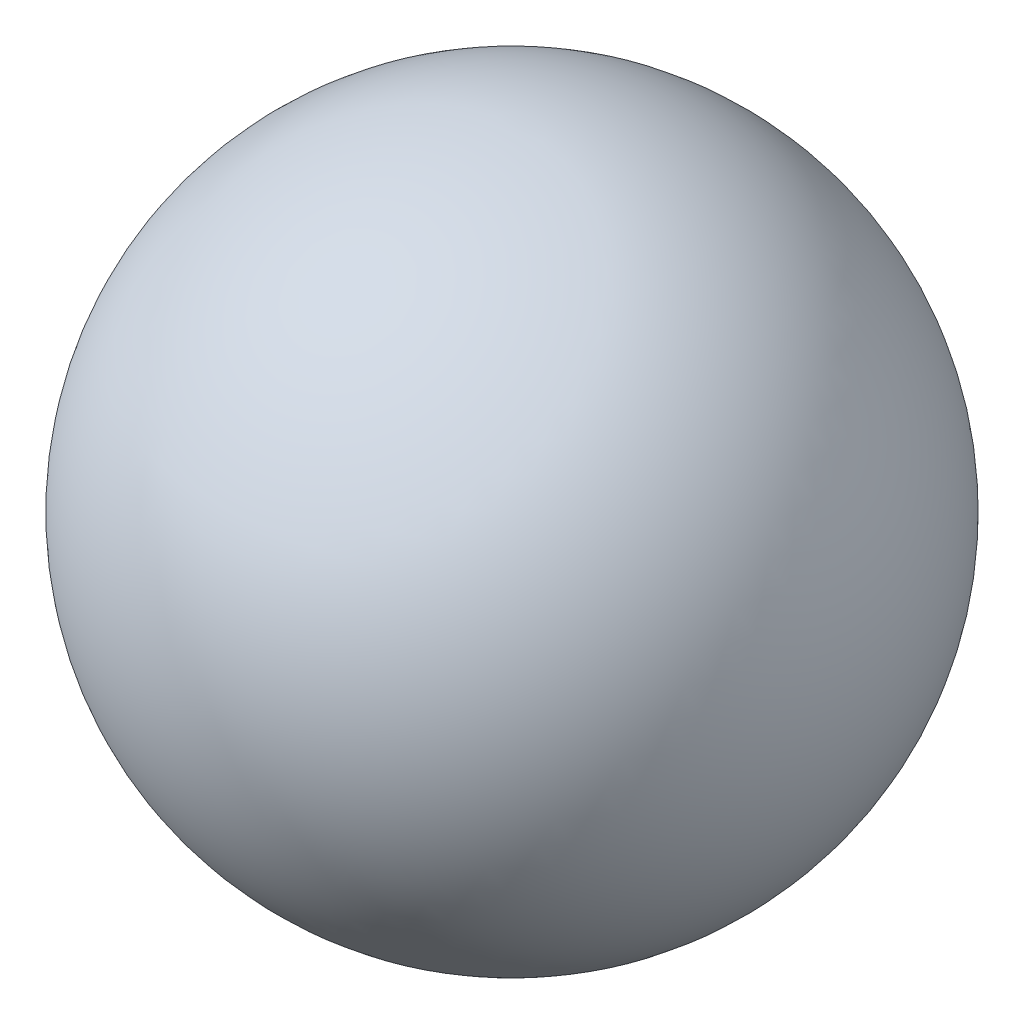
ISO-10303-21;
HEADER;
FILE_DESCRIPTION(('STEP AP214'),'2;1');
FILE_NAME('part.step','',(''),(''),'','','');
FILE_SCHEMA(('AUTOMOTIVE_DESIGN { 1 0 10303 214 1 1 1 1 }'));
ENDSEC;
DATA;
#1=APPLICATION_CONTEXT('core data for automotive mechanical design processes');
#2=APPLICATION_PROTOCOL_DEFINITION('international standard','automotive_design',2000,#1);
#3=PRODUCT_CONTEXT('',#1,'mechanical');
#4=PRODUCT('Part','Part','',(#3));
#5=PRODUCT_RELATED_PRODUCT_CATEGORY('part','',(#4));
#6=PRODUCT_DEFINITION_FORMATION('','',#4);
#7=PRODUCT_DEFINITION_CONTEXT('part definition',#1,'design');
#8=PRODUCT_DEFINITION('design','',#6,#7);
#9=PRODUCT_DEFINITION_SHAPE('','',#8);
#10=(LENGTH_UNIT() NAMED_UNIT(*) SI_UNIT(.MILLI.,.METRE.));
#11=(NAMED_UNIT(*) PLANE_ANGLE_UNIT() SI_UNIT($,.RADIAN.));
#12=(NAMED_UNIT(*) SI_UNIT($,.STERADIAN.) SOLID_ANGLE_UNIT());
#13=UNCERTAINTY_MEASURE_WITH_UNIT(LENGTH_MEASURE(1.E-05),#10,'distance_accuracy_value','');
#14=(GEOMETRIC_REPRESENTATION_CONTEXT(3) GLOBAL_UNCERTAINTY_ASSIGNED_CONTEXT((#13)) GLOBAL_UNIT_ASSIGNED_CONTEXT((#10,
#11,#12)) REPRESENTATION_CONTEXT('',''));
#15=CARTESIAN_POINT('',(0.,0.,0.));
#16=DIRECTION('',(0.,0.,1.));
#17=DIRECTION('',(1.,0.,0.));
#18=AXIS2_PLACEMENT_3D('',#15,#16,#17);
#19=CARTESIAN_POINT('',(0.,0.,0.));
#20=DIRECTION('',(0.,-1.,0.));
#21=DIRECTION('',(-1.,0.,0.));
#22=AXIS2_PLACEMENT_3D('',#19,#20,#21);
#23=SPHERICAL_SURFACE('',#22,9.525);
#24=CARTESIAN_POINT('',(0.,-9.525,0.));
#25=VERTEX_POINT('',#24);
#26=VERTEX_LOOP('',#25);
#27=FACE_BOUND('',#26,.T.);
#28=ADVANCED_FACE('F29',(#27),#23,.T.);
#29=CLOSED_SHELL('',(#28));
#30=MANIFOLD_SOLID_BREP('B2',#29);
#31=ADVANCED_BREP_SHAPE_REPRESENTATION('',(#18,#30),#14);
#32=SHAPE_DEFINITION_REPRESENTATION(#9,#31);
ENDSEC;
END-ISO-10303-21;
